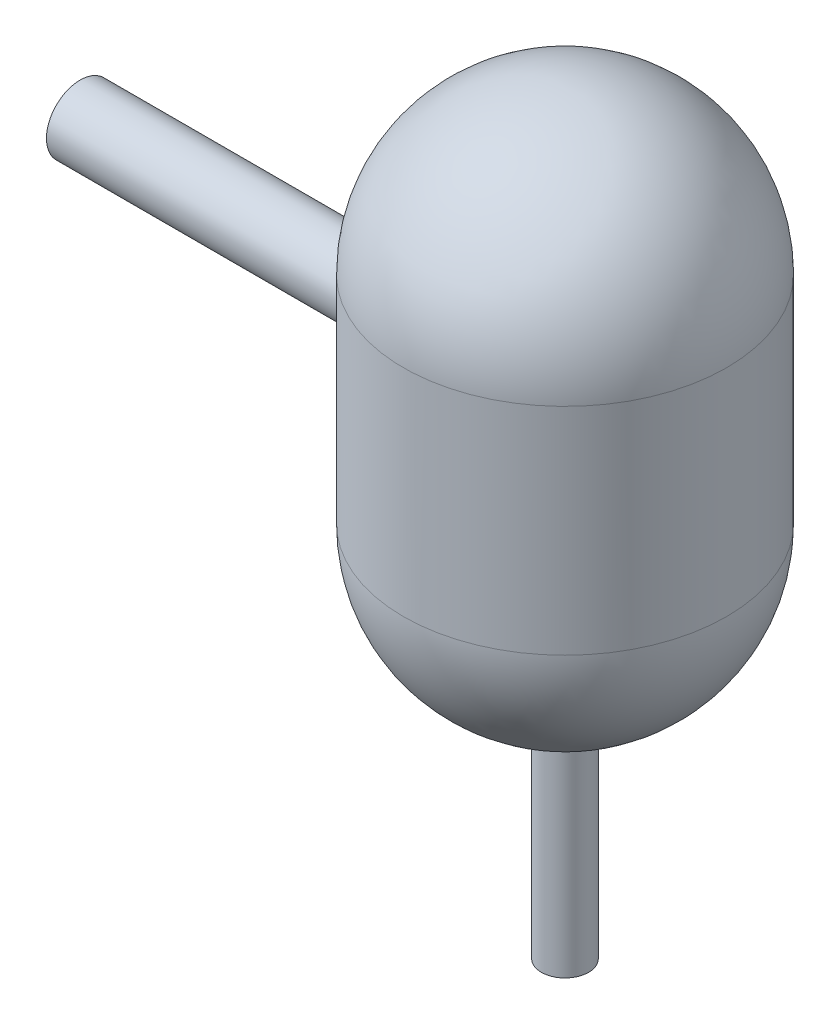
ISO-10303-21;
HEADER;
FILE_DESCRIPTION(('STEP AP214'),'2;1');
FILE_NAME('part.step','',(''),(''),'','','');
FILE_SCHEMA(('AUTOMOTIVE_DESIGN { 1 0 10303 214 1 1 1 1 }'));
ENDSEC;
DATA;
#1=APPLICATION_CONTEXT('core data for automotive mechanical design processes');
#2=APPLICATION_PROTOCOL_DEFINITION('international standard','automotive_design',2000,#1);
#3=PRODUCT_CONTEXT('',#1,'mechanical');
#4=PRODUCT('Part','Part','',(#3));
#5=PRODUCT_RELATED_PRODUCT_CATEGORY('part','',(#4));
#6=PRODUCT_DEFINITION_FORMATION('','',#4);
#7=PRODUCT_DEFINITION_CONTEXT('part definition',#1,'design');
#8=PRODUCT_DEFINITION('design','',#6,#7);
#9=PRODUCT_DEFINITION_SHAPE('','',#8);
#10=(LENGTH_UNIT() NAMED_UNIT(*) SI_UNIT(.MILLI.,.METRE.));
#11=(NAMED_UNIT(*) PLANE_ANGLE_UNIT() SI_UNIT($,.RADIAN.));
#12=(NAMED_UNIT(*) SI_UNIT($,.STERADIAN.) SOLID_ANGLE_UNIT());
#13=UNCERTAINTY_MEASURE_WITH_UNIT(LENGTH_MEASURE(1.E-05),#10,'distance_accuracy_value','');
#14=(GEOMETRIC_REPRESENTATION_CONTEXT(3) GLOBAL_UNCERTAINTY_ASSIGNED_CONTEXT((#13)) GLOBAL_UNIT_ASSIGNED_CONTEXT((#10,
#11,#12)) REPRESENTATION_CONTEXT('',''));
#15=CARTESIAN_POINT('',(0.,0.,0.));
#16=DIRECTION('',(0.,0.,1.));
#17=DIRECTION('',(1.,0.,0.));
#18=AXIS2_PLACEMENT_3D('',#15,#16,#17);
#19=CARTESIAN_POINT('',(0.,-101.6,0.));
#20=DIRECTION('',(0.,-1.,0.));
#21=DIRECTION('',(-1.,0.,0.));
#22=AXIS2_PLACEMENT_3D('',#19,#20,#21);
#23=SPHERICAL_SURFACE('',#22,152.4);
#24=CARTESIAN_POINT('',(-1.03462777964164E-12,-101.599999999999,0.));
#25=DIRECTION('',(0.,-1.,0.));
#26=DIRECTION('',(1.,0.,0.));
#27=AXIS2_PLACEMENT_3D('',#24,#25,#26);
#28=CIRCLE('',#27,152.399999999999);
#29=CARTESIAN_POINT('',(152.399999999998,-101.599999999998,0.));
#30=VERTEX_POINT('',#29);
#31=EDGE_CURVE('E58',#30,#30,#28,.T.);
#32=ORIENTED_EDGE('',*,*,#31,.T.);
#33=EDGE_LOOP('',(#32));
#34=FACE_BOUND('',#33,.T.);
#35=CARTESIAN_POINT('',(-2.4741099078387E-12,-252.370717896414,0.));
#36=DIRECTION('',(0.,1.,0.));
#37=DIRECTION('',(0.,0.,1.));
#38=AXIS2_PLACEMENT_3D('',#35,#36,#37);
#39=CIRCLE('',#38,22.225);
#40=CARTESIAN_POINT('',(-2.4741099078387E-12,-252.370717896414,22.225));
#41=VERTEX_POINT('',#40);
#42=EDGE_CURVE('E10',#41,#41,#39,.F.);
#43=ORIENTED_EDGE('',*,*,#42,.F.);
#44=EDGE_LOOP('',(#43));
#45=FACE_BOUND('',#44,.T.);
#46=ADVANCED_FACE('F43',(#34,#45),#23,.T.);
#47=CARTESIAN_POINT('',(0.,-101.6,0.));
#48=DIRECTION('',(0.,-1.,0.));
#49=DIRECTION('',(-1.,0.,0.));
#50=AXIS2_PLACEMENT_3D('',#47,#48,#49);
#51=SPHERICAL_SURFACE('',#50,146.05);
#52=CARTESIAN_POINT('',(-2.4741099078387E-12,-246.784664737706,0.));
#53=DIRECTION('',(0.,1.,0.));
#54=DIRECTION('',(0.,0.,1.));
#55=AXIS2_PLACEMENT_3D('',#52,#53,#54);
#56=CIRCLE('',#55,15.875);
#57=CARTESIAN_POINT('',(-2.4741099078387E-12,-246.784664737706,15.875));
#58=VERTEX_POINT('',#57);
#59=EDGE_CURVE('E142',#58,#58,#56,.F.);
#60=ORIENTED_EDGE('',*,*,#59,.T.);
#61=EDGE_LOOP('',(#60));
#62=FACE_BOUND('',#61,.T.);
#63=CARTESIAN_POINT('',(-1.03462777964164E-12,-101.599999999999,0.));
#64=DIRECTION('',(0.,-1.,0.));
#65=DIRECTION('',(1.,0.,0.));
#66=AXIS2_PLACEMENT_3D('',#63,#64,#65);
#67=CIRCLE('',#66,146.049999999999);
#68=CARTESIAN_POINT('',(146.049999999998,-101.599999999998,0.));
#69=VERTEX_POINT('',#68);
#70=EDGE_CURVE('E92',#69,#69,#67,.T.);
#71=ORIENTED_EDGE('',*,*,#70,.F.);
#72=EDGE_LOOP('',(#71));
#73=FACE_BOUND('',#72,.T.);
#74=ADVANCED_FACE('F111',(#62,#73),#51,.F.);
#75=CARTESIAN_POINT('',(0.,-254.,0.));
#76=DIRECTION('',(0.,-1.,0.));
#77=DIRECTION('',(1.,0.,0.));
#78=AXIS2_PLACEMENT_3D('',#75,#76,#77);
#79=CYLINDRICAL_SURFACE('',#78,146.049999999998);
#80=CARTESIAN_POINT('',(-143.824345991908,0.,-25.4));
#81=CARTESIAN_POINT('',(-143.824347807057,0.707648257176729,-25.399995821681));
#82=CARTESIAN_POINT('',(-143.829582867261,1.41539647863002,-25.3704018282657));
#83=CARTESIAN_POINT('',(-143.850375477723,2.82588085579064,-25.252237046442));
#84=CARTESIAN_POINT('',(-143.865935012859,3.52861602147658,-25.1636549175652));
#85=CARTESIAN_POINT('',(-143.906937009391,4.92454150658197,-24.9281021694573));
#86=CARTESIAN_POINT('',(-143.932387545546,5.61772354708535,-24.7810838421865));
#87=CARTESIAN_POINT('',(-143.992427172831,6.98897826584363,-24.429799805628));
#88=CARTESIAN_POINT('',(-144.027015837571,7.66705164747717,-24.2255367673854));
#89=CARTESIAN_POINT('',(-144.104297482863,9.00279286287746,-23.7615061126563));
#90=CARTESIAN_POINT('',(-144.146983442195,9.66047780500446,-23.5017865585664));
#91=CARTESIAN_POINT('',(-144.23925822079,10.9515182286093,-22.9286519436764));
#92=CARTESIAN_POINT('',(-144.28884711413,11.584873448904,-22.6152363066381));
#93=CARTESIAN_POINT('',(-144.393517065279,12.8228586851106,-21.9370095635899));
#94=CARTESIAN_POINT('',(-144.448597458254,13.4274921651948,-21.5722046768689));
#95=CARTESIAN_POINT('',(-144.562712139294,14.6040449900417,-20.7937359442799));
#96=CARTESIAN_POINT('',(-144.621746448451,15.1759641602588,-20.3800718377619));
#97=CARTESIAN_POINT('',(-144.742708320547,16.2885827603647,-19.5025350584804));
#98=CARTESIAN_POINT('',(-144.80465822912,16.8289295088241,-19.0382182425419));
#99=CARTESIAN_POINT('',(-144.929176530965,17.8686929569893,-18.065891977486));
#100=CARTESIAN_POINT('',(-144.991744928355,18.3681093840228,-17.5578822373385));
#101=CARTESIAN_POINT('',(-145.115753711906,19.3226158170212,-16.5016132642202));
#102=CARTESIAN_POINT('',(-145.177194030093,19.7777031589424,-15.9533516156998));
#103=CARTESIAN_POINT('',(-145.297227821752,20.6403590182705,-14.8203425050741));
#104=CARTESIAN_POINT('',(-145.355821290217,21.0479274521135,-14.2355949788097));
#105=CARTESIAN_POINT('',(-145.468893963858,21.8151686746619,-13.0296761908167));
#106=CARTESIAN_POINT('',(-145.523343769653,22.1745109465809,-12.4082918112134));
#107=CARTESIAN_POINT('',(-145.626157491419,22.8395100309856,-11.1369394560982));
#108=CARTESIAN_POINT('',(-145.674521372543,23.1451665360746,-10.4869713169468));
#109=CARTESIAN_POINT('',(-145.763783293351,23.700488823567,-9.16308145477337));
#110=CARTESIAN_POINT('',(-145.804681741947,23.9501576728057,-8.48916104612861));
#111=CARTESIAN_POINT('',(-145.877845187748,24.3916101485101,-7.1221644552611));
#112=CARTESIAN_POINT('',(-145.9101102796,24.5833944095597,-6.42908848313016));
#113=CARTESIAN_POINT('',(-145.964803819999,24.9059527554945,-5.03583929871039));
#114=CARTESIAN_POINT('',(-145.987327703986,25.037319601974,-4.33580704107009));
#115=CARTESIAN_POINT('',(-146.022368263055,25.240832101951,-2.92693770435822));
#116=CARTESIAN_POINT('',(-146.034884998333,25.3129781116721,-2.2181006782749));
#117=CARTESIAN_POINT('',(-146.049555377186,25.3974775110331,-0.796810686860324));
#118=CARTESIAN_POINT('',(-146.051709692722,25.4098347777211,-0.084357958991349));
#119=CARTESIAN_POINT('',(-146.045595705925,25.3746689724365,1.33902080227587));
#120=CARTESIAN_POINT('',(-146.037327464503,25.3271462504128,2.04994684457201));
#121=CARTESIAN_POINT('',(-146.010748312432,25.1734336112786,3.45745657206592));
#122=CARTESIAN_POINT('',(-145.99254681565,25.0678827765428,4.15411223343312));
#123=CARTESIAN_POINT('',(-145.946681091934,24.7993689150846,5.53594497609554));
#124=CARTESIAN_POINT('',(-145.919016944358,24.636406369852,6.22112215360589));
#125=CARTESIAN_POINT('',(-145.854989648688,24.2542974819815,7.57522072684865));
#126=CARTESIAN_POINT('',(-145.818626311805,24.0351499200238,8.24414176944765));
#127=CARTESIAN_POINT('',(-145.738200993434,23.5422979759573,9.56109486771525));
#128=CARTESIAN_POINT('',(-145.694138953938,23.268593182781,10.2091267659496));
#129=CARTESIAN_POINT('',(-145.599288591401,22.6671329220875,11.4830164947222));
#130=CARTESIAN_POINT('',(-145.548468168358,22.3391175526676,12.1087492097825));
#131=CARTESIAN_POINT('',(-145.441668404424,21.6323457234573,13.3304020605812));
#132=CARTESIAN_POINT('',(-145.385689053291,21.2535891629447,13.9263221371377));
#133=CARTESIAN_POINT('',(-145.270102032402,20.4479562649196,15.0843846610752));
#134=CARTESIAN_POINT('',(-145.210494094353,20.021076367245,15.6465246046812));
#135=CARTESIAN_POINT('',(-145.089285570395,19.1221487604475,16.7332210182079));
#136=CARTESIAN_POINT('',(-145.027684966066,18.6501006337089,17.2577771405583));
#137=CARTESIAN_POINT('',(-144.903362559402,17.657506820852,18.2724596649401));
#138=CARTESIAN_POINT('',(-144.840636699526,17.1364025771226,18.7620393388891));
#139=CARTESIAN_POINT('',(-144.716643037094,16.0546843057178,19.6956224664764));
#140=CARTESIAN_POINT('',(-144.655375248071,15.4940699115282,20.139625497231));
#141=CARTESIAN_POINT('',(-144.536037087598,14.3371715761573,20.9789473294528));
#142=CARTESIAN_POINT('',(-144.477966766337,13.740887075379,21.374265366846));
#143=CARTESIAN_POINT('',(-144.366687648799,12.5167667457953,22.1133836361457));
#144=CARTESIAN_POINT('',(-144.313478836638,11.8889310200937,22.457184036388));
#145=CARTESIAN_POINT('',(-144.213395229281,10.6052250824016,23.0911742446873));
#146=CARTESIAN_POINT('',(-144.166528863319,9.94931905816197,23.3812928930091));
#147=CARTESIAN_POINT('',(-144.0805860946,8.61487447540916,23.9051821125154));
#148=CARTESIAN_POINT('',(-144.041509710355,7.93633586311658,24.1389525497949));
#149=CARTESIAN_POINT('',(-143.972306734024,6.56154201150715,24.5483305653718));
#150=CARTESIAN_POINT('',(-143.942179435464,5.86528817540746,24.723942735018));
#151=CARTESIAN_POINT('',(-143.891771094237,4.46007271501071,25.0156483618437));
#152=CARTESIAN_POINT('',(-143.871489934197,3.75111124229909,25.1317425285066));
#153=CARTESIAN_POINT('',(-143.841579168945,2.33495631498476,25.3023716054257));
#154=CARTESIAN_POINT('',(-143.831814528806,1.62785967784538,25.3576871211702));
#155=CARTESIAN_POINT('',(-143.822757955174,0.211452945372394,25.4090040165655));
#156=CARTESIAN_POINT('',(-143.823465931455,-0.49785713083916,25.4050059072202));
#157=CARTESIAN_POINT('',(-143.835333421474,-1.91354187559937,25.3377290883641));
#158=CARTESIAN_POINT('',(-143.846492518307,-2.61991666011012,25.2744527435084));
#159=CARTESIAN_POINT('',(-143.878933177989,-4.024674530993,25.0891194878487));
#160=CARTESIAN_POINT('',(-143.900214726671,-4.72305762854722,24.9670626593018));
#161=CARTESIAN_POINT('',(-143.952094668874,-6.10200804397299,24.6661719465222));
#162=CARTESIAN_POINT('',(-143.982626996842,-6.78266568807636,24.4877402953492));
#163=CARTESIAN_POINT('',(-144.052182269333,-8.12643720208554,24.0751946551926));
#164=CARTESIAN_POINT('',(-144.09120516187,-8.78955117938319,23.8410810071485));
#165=CARTESIAN_POINT('',(-144.176635194887,-10.0937161214814,23.3188831154622));
#166=CARTESIAN_POINT('',(-144.223042701,-10.7347659919193,23.0307961993407));
#167=CARTESIAN_POINT('',(-144.3219357512,-11.9904312563902,22.4027311788599));
#168=CARTESIAN_POINT('',(-144.37442135786,-12.6050463781989,22.0627525402849));
#169=CARTESIAN_POINT('',(-144.484558392452,-13.8097263668991,21.3296411481074));
#170=CARTESIAN_POINT('',(-144.542256248718,-14.3994841024864,20.93601064082));
#171=CARTESIAN_POINT('',(-144.660739770068,-15.5438441399908,20.10101037391));
#172=CARTESIAN_POINT('',(-144.721525452843,-16.0984462404461,19.659640340752));
#173=CARTESIAN_POINT('',(-144.8444930869,-17.1687912766033,18.7321674831355));
#174=CARTESIAN_POINT('',(-144.90667513223,-17.6845315846245,18.2460616387462));
#175=CARTESIAN_POINT('',(-145.030707059412,-18.6736255763226,17.2324446412533));
#176=CARTESIAN_POINT('',(-145.092556939202,-19.1469789971406,16.7049332314145));
#177=CARTESIAN_POINT('',(-145.214908682454,-20.0532075212375,15.6058303279756));
#178=CARTESIAN_POINT('',(-145.275387141594,-20.485559674667,15.0338048892952));
#179=CARTESIAN_POINT('',(-145.392546661306,-21.3005353958863,13.8549863411238));
#180=CARTESIAN_POINT('',(-145.449227688984,-21.6831585329414,13.2481929305508));
#181=CARTESIAN_POINT('',(-145.557186768036,-22.395898336675,12.0040692550062));
#182=CARTESIAN_POINT('',(-145.608464944709,-22.7260162210963,11.3667396986988));
#183=CARTESIAN_POINT('',(-145.704163274329,-23.3313106648686,10.0660072115682));
#184=CARTESIAN_POINT('',(-145.74858348121,-23.6064876562936,9.40260448584233));
#185=CARTESIAN_POINT('',(-145.829109570533,-24.0986597209623,8.05760528022181));
#186=CARTESIAN_POINT('',(-145.865253485425,-24.3159217225833,7.37610876873769));
#187=CARTESIAN_POINT('',(-145.928465866419,-24.6922883363599,5.9968245975265));
#188=CARTESIAN_POINT('',(-145.955534349215,-24.8513930555009,5.29903696777092));
#189=CARTESIAN_POINT('',(-145.999821514453,-25.1101903594269,3.89227320422706));
#190=CARTESIAN_POINT('',(-146.017040939194,-25.2098874216497,3.18329791776563));
#191=CARTESIAN_POINT('',(-146.041139598766,-25.3490961435204,1.75929055965304));
#192=CARTESIAN_POINT('',(-146.048018935651,-25.388608397182,1.04425854785076));
#193=CARTESIAN_POINT('',(-146.051219467772,-25.4070122442899,-0.377166103816299));
#194=CARTESIAN_POINT('',(-146.047678730381,-25.386696563413,-1.08354829622425));
#195=CARTESIAN_POINT('',(-146.030436147858,-25.2873124631685,-2.49203685505949));
#196=CARTESIAN_POINT('',(-146.016734398309,-25.2082445964772,-3.19414326164609));
#197=CARTESIAN_POINT('',(-145.979552574292,-24.9919705993141,-4.5890690762766));
#198=CARTESIAN_POINT('',(-145.956072609162,-24.8547651189337,-5.28188858807667));
#199=CARTESIAN_POINT('',(-145.899987807061,-24.5232664505549,-6.65335327468512));
#200=CARTESIAN_POINT('',(-145.867382940593,-24.3289730780208,-7.33199840366743));
#201=CARTESIAN_POINT('',(-145.794000754214,-23.8850574418073,-8.66947846228425));
#202=CARTESIAN_POINT('',(-145.753234359828,-23.6355090990113,-9.32833853573117));
#203=CARTESIAN_POINT('',(-145.66462323225,-23.082771301227,-10.6226583427382));
#204=CARTESIAN_POINT('',(-145.616778515182,-22.7795819684367,-11.2581181296019));
#205=CARTESIAN_POINT('',(-145.515317844999,-22.1217268142548,-12.5013530262214));
#206=CARTESIAN_POINT('',(-145.461701669137,-21.7670590058859,-13.1091270661666));
#207=CARTESIAN_POINT('',(-145.350160709963,-21.0087437381572,-14.292892925122));
#208=CARTESIAN_POINT('',(-145.292235884311,-20.6050957974516,-14.8688844317126));
#209=CARTESIAN_POINT('',(-145.172915197401,-19.7462860744045,-15.9921923007209));
#210=CARTESIAN_POINT('',(-145.111485143607,-19.2905463971028,-16.5390632961552));
#211=CARTESIAN_POINT('',(-144.987534233838,-18.3348578366097,-17.5925782736547));
#212=CARTESIAN_POINT('',(-144.925013365922,-17.834908469242,-18.0992218150409));
#213=CARTESIAN_POINT('',(-144.800612455973,-16.7941004367084,-19.0689331326828));
#214=CARTESIAN_POINT('',(-144.738732568488,-16.2532321550324,-19.5319906078697));
#215=CARTESIAN_POINT('',(-144.617366556769,-15.1343784736904,-20.4111927782819));
#216=CARTESIAN_POINT('',(-144.557880409543,-14.5563934306569,-20.8273379241535));
#217=CARTESIAN_POINT('',(-144.442535694809,-13.3626059875842,-21.6128494231936));
#218=CARTESIAN_POINT('',(-144.386708968154,-12.746544241106,-21.9818264419696));
#219=CARTESIAN_POINT('',(-144.280809536048,-11.484969111572,-22.6665079126069));
#220=CARTESIAN_POINT('',(-144.230737156037,-10.8394540656599,-22.9822093519286));
#221=CARTESIAN_POINT('',(-144.137858245167,-9.52416088850097,-23.5577002561487));
#222=CARTESIAN_POINT('',(-144.095045254956,-8.85440497748424,-23.817539482586));
#223=CARTESIAN_POINT('',(-144.017902872834,-7.49493381581031,-24.2796446460518));
#224=CARTESIAN_POINT('',(-143.983571693804,-6.80522280396581,-24.4819227125887));
#225=CARTESIAN_POINT('',(-143.932829627879,-5.60941335844449,-24.7781877367034));
#226=CARTESIAN_POINT('',(-143.914099454482,-5.10693637753417,-24.8866099697526));
#227=CARTESIAN_POINT('',(-143.881774919678,-4.09606893361758,-25.0728205036862));
#228=CARTESIAN_POINT('',(-143.8681813152,-3.58767761043929,-25.1506042897416));
#229=CARTESIAN_POINT('',(-143.846347560508,-2.56700566094737,-25.2751815130496));
#230=CARTESIAN_POINT('',(-143.838107324688,-2.05472509695995,-25.3219754458678));
#231=CARTESIAN_POINT('',(-143.827106297981,-1.02831375197169,-25.3843838342496));
#232=CARTESIAN_POINT('',(-143.824344673005,-0.514183264553841,-25.4000030360023));
#233=CARTESIAN_POINT('',(-143.824345991908,0.,-25.4));
#234=B_SPLINE_CURVE_WITH_KNOTS('',3,(#80,#81,#82,#83,#84,#85,#86,#87,#88,#89,#90,#91,#92,#93,
#94,#95,#96,#97,#98,#99,#100,#101,#102,#103,#104,#105,#106,#107,#108,#109,#110,#111,#112,#113,
#114,#115,#116,#117,#118,#119,#120,#121,#122,#123,#124,#125,#126,#127,#128,#129,#130,#131,#132,
#133,#134,#135,#136,#137,#138,#139,#140,#141,#142,#143,#144,#145,#146,#147,#148,#149,#150,#151,
#152,#153,#154,#155,#156,#157,#158,#159,#160,#161,#162,#163,#164,#165,#166,#167,#168,#169,#170,
#171,#172,#173,#174,#175,#176,#177,#178,#179,#180,#181,#182,#183,#184,#185,#186,#187,#188,#189,
#190,#191,#192,#193,#194,#195,#196,#197,#198,#199,#200,#201,#202,#203,#204,#205,#206,#207,#208,
#209,#210,#211,#212,#213,#214,#215,#216,#217,#218,#219,#220,#221,#222,#223,#224,#225,#226,#227,
#228,#229,#230,#231,#232,#233),.UNSPECIFIED.,.T.,.F.,(4,2,2,2,2,2,2,2,2,2,2,2,2,2,2,2,2,2,2,2,2,
2,2,2,2,2,2,2,2,2,2,2,2,2,2,2,2,2,2,2,2,2,2,2,2,2,2,2,2,2,2,2,2,2,2,2,2,2,2,2,2,2,2,2,2,2,2,2,2,
2,2,2,2,2,2,2,4),(0.,2.12248165687478,4.24537147867325,6.36999802580033,8.49452545410012,
10.6172190418535,12.7399354106748,14.8623951020312,16.9848661166136,19.1277261221698,
21.2706004020114,23.4136033827572,25.5566101320027,27.7136259816848,29.8706541817156,
32.0275641973542,34.1844505661053,36.3196987160541,38.4549340220188,40.5900308651172,
42.7251152304029,44.8371430588732,46.9491531750037,49.0612091295763,51.1732809982649,
53.2957688544981,55.4182609239771,57.5409101184853,59.6635789404442,61.8143046689101,
63.9650503511195,66.115829783348,68.266602187672,70.4202055128107,72.5738139556907,
74.7272523397619,76.8806650532077,79.0060850541468,81.1314867439941,83.2568036535209,
85.382117588905,87.4925974670659,89.60306442314,91.7136359063315,93.8242291189286,
95.9559378437351,98.0876587833405,100.219523732377,102.351401901092,104.507582650097,
106.663782073909,108.819931482172,110.976063933077,113.122079934563,115.268091988239,
117.413942280757,119.559771393968,121.677296540117,123.794801767152,125.91228331699,
128.02977171163,130.14444423449,132.259111940031,134.373861289686,136.488631423449,
138.629685269085,140.770762566046,142.912344618254,145.053906096372,147.212137238231,
149.370490379319,151.526912839205,153.682880552418,155.22512617946,156.767598984231,
158.310047122382,159.852260412982),.UNSPECIFIED.);
#235=CARTESIAN_POINT('',(-143.824345991908,0.,-25.4));
#236=VERTEX_POINT('',#235);
#237=EDGE_CURVE('E81',#236,#236,#234,.T.);
#238=ORIENTED_EDGE('',*,*,#237,.F.);
#239=EDGE_LOOP('',(#238));
#240=FACE_BOUND('',#239,.T.);
#241=CARTESIAN_POINT('',(-2.4741099078387E-12,101.600000000001,0.));
#242=DIRECTION('',(0.,-1.,0.));
#243=DIRECTION('',(1.,0.,0.));
#244=AXIS2_PLACEMENT_3D('',#241,#242,#243);
#245=CIRCLE('',#244,146.049999999998);
#246=CARTESIAN_POINT('',(146.049999999995,101.600000000002,0.));
#247=VERTEX_POINT('',#246);
#248=EDGE_CURVE('E87',#247,#247,#245,.T.);
#249=ORIENTED_EDGE('',*,*,#248,.F.);
#250=EDGE_LOOP('',(#249));
#251=FACE_BOUND('',#250,.T.);
#252=ORIENTED_EDGE('',*,*,#70,.T.);
#253=EDGE_LOOP('',(#252));
#254=FACE_BOUND('',#253,.T.);
#255=ADVANCED_FACE('F115',(#240,#251,#254),#79,.F.);
#256=CARTESIAN_POINT('',(0.,101.6,0.));
#257=DIRECTION('',(0.,-1.,0.));
#258=DIRECTION('',(-1.,0.,0.));
#259=AXIS2_PLACEMENT_3D('',#256,#257,#258);
#260=SPHERICAL_SURFACE('',#259,146.05);
#261=ORIENTED_EDGE('',*,*,#248,.T.);
#262=EDGE_LOOP('',(#261));
#263=FACE_BOUND('',#262,.T.);
#264=ADVANCED_FACE('F120',(#263),#260,.F.);
#265=CARTESIAN_POINT('',(-152.401,0.,0.));
#266=DIRECTION('',(1.,0.,0.));
#267=DIRECTION('',(0.,0.,-1.));
#268=AXIS2_PLACEMENT_3D('',#265,#266,#267);
#269=CYLINDRICAL_SURFACE('',#268,25.4);
#270=ORIENTED_EDGE('',*,*,#237,.T.);
#271=EDGE_LOOP('',(#270));
#272=FACE_BOUND('',#271,.T.);
#273=CARTESIAN_POINT('',(-457.2,0.,0.));
#274=DIRECTION('',(1.,0.,0.));
#275=DIRECTION('',(0.,0.,-1.));
#276=AXIS2_PLACEMENT_3D('',#273,#274,#275);
#277=CIRCLE('',#276,25.4);
#278=CARTESIAN_POINT('',(-457.2,0.,-25.4));
#279=VERTEX_POINT('',#278);
#280=EDGE_CURVE('E88',#279,#279,#277,.T.);
#281=ORIENTED_EDGE('',*,*,#280,.F.);
#282=EDGE_LOOP('',(#281));
#283=FACE_BOUND('',#282,.T.);
#284=ADVANCED_FACE('F73',(#272,#283),#269,.F.);
#285=CARTESIAN_POINT('',(152.400999999998,0.,0.));
#286=DIRECTION('',(-1.,0.,0.));
#287=DIRECTION('',(0.,0.,1.));
#288=AXIS2_PLACEMENT_3D('',#285,#286,#287);
#289=CYLINDRICAL_SURFACE('',#288,31.75);
#290=CARTESIAN_POINT('',(-457.2,0.,0.));
#291=DIRECTION('',(1.,0.,0.));
#292=DIRECTION('',(0.,0.,-1.));
#293=AXIS2_PLACEMENT_3D('',#290,#291,#292);
#294=CIRCLE('',#293,31.75);
#295=CARTESIAN_POINT('',(-457.2,0.,-31.75));
#296=VERTEX_POINT('',#295);
#297=EDGE_CURVE('E140',#296,#296,#294,.T.);
#298=ORIENTED_EDGE('',*,*,#297,.T.);
#299=EDGE_LOOP('',(#298));
#300=FACE_BOUND('',#299,.T.);
#301=CARTESIAN_POINT('',(-149.05602134768,0.,31.75));
#302=CARTESIAN_POINT('',(-149.056023793011,0.881361721170962,31.7499952828106));
#303=CARTESIAN_POINT('',(-149.063859807178,1.76282805008693,31.713269405636));
#304=CARTESIAN_POINT('',(-149.094978038728,3.51946176256128,31.5666437928695));
#305=CARTESIAN_POINT('',(-149.118262741641,4.39462810961189,31.4567322824722));
#306=CARTESIAN_POINT('',(-149.179606564309,6.13289927227794,31.1645194418269));
#307=CARTESIAN_POINT('',(-149.217675932306,6.99599529026554,30.9821678965273));
#308=CARTESIAN_POINT('',(-149.307463028166,8.70332289076777,30.5465360443894));
#309=CARTESIAN_POINT('',(-149.359180238586,9.54755518716528,30.2932584266189));
#310=CARTESIAN_POINT('',(-149.474693960176,11.2104401207116,29.7180374402765));
#311=CARTESIAN_POINT('',(-149.538477812951,12.0291185257382,29.3961659850469));
#312=CARTESIAN_POINT('',(-149.676329226527,13.6362424040242,28.6860106989017));
#313=CARTESIAN_POINT('',(-149.750396874912,14.4246876197241,28.2977263023616));
#314=CARTESIAN_POINT('',(-149.906715653356,15.9660196496083,27.4575865536702));
#315=CARTESIAN_POINT('',(-149.988966241035,16.7189088156512,27.0057354140362));
#316=CARTESIAN_POINT('',(-150.159363235695,18.1842384302228,26.0416048805845));
#317=CARTESIAN_POINT('',(-150.247509696821,18.8966785071906,25.5293249318072));
#318=CARTESIAN_POINT('',(-150.42851221403,20.2859738197001,24.4403649007374));
#319=CARTESIAN_POINT('',(-150.521416408337,20.9622039446122,23.8628951456976));
#320=CARTESIAN_POINT('',(-150.708192854998,22.2638009244068,22.6533654850093));
#321=CARTESIAN_POINT('',(-150.802065116117,22.8891673183038,22.0213050847046));
#322=CARTESIAN_POINT('',(-150.988175506019,24.0848609822646,20.7067965021893));
#323=CARTESIAN_POINT('',(-151.080413517565,24.6551843166605,20.0243447230623));
#324=CARTESIAN_POINT('',(-151.260693274568,25.7368275134811,18.6136565672592));
#325=CARTESIAN_POINT('',(-151.3487350084,26.2481472124502,17.885420063756));
#326=CARTESIAN_POINT('',(-151.518989288063,27.2127585283132,16.3809136844706));
#327=CARTESIAN_POINT('',(-151.601138365452,27.6654514190504,15.6042525526756));
#328=CARTESIAN_POINT('',(-151.756344803468,28.5036913070007,14.0146165246614));
#329=CARTESIAN_POINT('',(-151.829402088581,28.8892377465196,13.2016413269013));
#330=CARTESIAN_POINT('',(-151.964336046109,29.5902058990911,11.5451700013931));
#331=CARTESIAN_POINT('',(-152.026213596907,29.9056331218008,10.7016762777157));
#332=CARTESIAN_POINT('',(-152.137017324175,30.4639042654189,8.99017370277654));
#333=CARTESIAN_POINT('',(-152.185943706476,30.7067493398678,8.12216524136494));
#334=CARTESIAN_POINT('',(-152.268835808032,31.1149521640189,6.38050305935047));
#335=CARTESIAN_POINT('',(-152.30300492904,31.2813655621775,5.50710637393582));
#336=CARTESIAN_POINT('',(-152.356419295733,31.5404043028025,3.74898518956694));
#337=CARTESIAN_POINT('',(-152.37566466933,31.6330302777071,2.86426078776956));
#338=CARTESIAN_POINT('',(-152.398683832391,31.7437281169389,1.09004008506075));
#339=CARTESIAN_POINT('',(-152.402459033338,31.7618067828883,0.200544226907542));
#340=CARTESIAN_POINT('',(-152.394434073458,31.72327845416,-1.57675367499099));
#341=CARTESIAN_POINT('',(-152.382634044699,31.6666720927621,-2.46455573303469));
#342=CARTESIAN_POINT('',(-152.344096160726,31.4806960669351,-4.2182642160708));
#343=CARTESIAN_POINT('',(-152.317592228358,31.3524656498803,-5.08429689303012));
#344=CARTESIAN_POINT('',(-152.250543254694,31.0250876174821,-6.80228581090756));
#345=CARTESIAN_POINT('',(-152.209998382413,30.8259408557812,-7.65424222113703));
#346=CARTESIAN_POINT('',(-152.115974232606,30.3582695887926,-9.33817939210086));
#347=CARTESIAN_POINT('',(-152.062494600092,30.0897431794079,-10.1701596039114));
#348=CARTESIAN_POINT('',(-151.944053174094,29.4853446474254,-11.808441589649));
#349=CARTESIAN_POINT('',(-151.879091261049,29.149471823561,-12.6147430960868));
#350=CARTESIAN_POINT('',(-151.73896542674,28.4103609760771,-14.2015892908402));
#351=CARTESIAN_POINT('',(-151.663735707029,28.0066842499214,-14.9819237970777));
#352=CARTESIAN_POINT('',(-151.505455112317,27.1364772667449,-16.5058792057833));
#353=CARTESIAN_POINT('',(-151.422404217005,26.6699468465,-17.2495000129033));
#354=CARTESIAN_POINT('',(-151.250714935924,25.6772312729437,-18.6952206417908));
#355=CARTESIAN_POINT('',(-151.16207596788,25.1510398984229,-19.3973161218239));
#356=CARTESIAN_POINT('',(-150.981606094898,24.0426041061395,-20.7553349681485));
#357=CARTESIAN_POINT('',(-150.88977514794,23.4603589503142,-21.4112577262848));
#358=CARTESIAN_POINT('',(-150.703652899894,22.232156485601,-22.684595898891));
#359=CARTESIAN_POINT('',(-150.609347917014,21.5852023431495,-23.3010482237509));
#360=CARTESIAN_POINT('',(-150.422647062936,20.2414877195149,-24.4773778533212));
#361=CARTESIAN_POINT('',(-150.330251216931,19.5447265816488,-25.0372544118705));
#362=CARTESIAN_POINT('',(-150.149986868233,18.1060832331567,-26.0965555409302));
#363=CARTESIAN_POINT('',(-150.062118494389,17.3641997396869,-26.5959783915133));
#364=CARTESIAN_POINT('',(-149.893433245691,15.8403634962124,-27.5307892961407));
#365=CARTESIAN_POINT('',(-149.812616341892,15.0584109107025,-27.9661776130364));
#366=CARTESIAN_POINT('',(-149.660193866448,13.4577960147782,-28.7707234964289));
#367=CARTESIAN_POINT('',(-149.588611873144,12.6390466640987,-29.1397124454041));
#368=CARTESIAN_POINT('',(-149.457022121294,10.9724168889283,-29.807287383968));
#369=CARTESIAN_POINT('',(-149.397014406869,10.1245363534011,-30.1058731051739));
#370=CARTESIAN_POINT('',(-149.290388284776,8.40583133622129,-30.6302403142809));
#371=CARTESIAN_POINT('',(-149.243768314355,7.53500954546865,-30.8560303000088));
#372=CARTESIAN_POINT('',(-149.165333277635,5.77671133906899,-31.2330032493508));
#373=CARTESIAN_POINT('',(-149.133517950778,4.88923521681956,-31.3841875260072));
#374=CARTESIAN_POINT('',(-149.08611646575,3.12079750355149,-31.6085870856365));
#375=CARTESIAN_POINT('',(-149.070240255903,2.2400203600631,-31.6831964221137));
#376=CARTESIAN_POINT('',(-149.05416712867,0.47517362492991,-31.7587275842125));
#377=CARTESIAN_POINT('',(-149.053970018497,-0.408895926098297,-31.7596503158728));
#378=CARTESIAN_POINT('',(-149.06926045314,-2.17384425519209,-31.6878039526567));
#379=CARTESIAN_POINT('',(-149.084747090119,-3.05472321497959,-31.6150391231004));
#380=CARTESIAN_POINT('',(-149.130939947624,-4.80695569981857,-31.3964201890013));
#381=CARTESIAN_POINT('',(-149.161646131204,-5.67830924798813,-31.2505662618851));
#382=CARTESIAN_POINT('',(-149.236963136472,-7.39609681065613,-30.8888736509908));
#383=CARTESIAN_POINT('',(-149.281423456751,-8.24269691678902,-30.6737914973254));
#384=CARTESIAN_POINT('',(-149.383066107913,-9.91459712449868,-30.1748952025384));
#385=CARTESIAN_POINT('',(-149.440248322397,-10.7398974208798,-29.8910816902685));
#386=CARTESIAN_POINT('',(-149.56571265622,-12.3636672556485,-29.2568286637143));
#387=CARTESIAN_POINT('',(-149.633995521078,-13.1621349876128,-28.9063846742612));
#388=CARTESIAN_POINT('',(-149.779744490879,-14.7268898777349,-28.1414224006901));
#389=CARTESIAN_POINT('',(-149.857210728587,-15.4931765704309,-27.7269031902032));
#390=CARTESIAN_POINT('',(-150.02032636375,-16.9990896499508,-26.8304316548779));
#391=CARTESIAN_POINT('',(-150.106075527279,-17.7381895126123,-26.3476129350963));
#392=CARTESIAN_POINT('',(-150.282415062209,-19.1732623502505,-25.3224433971349));
#393=CARTESIAN_POINT('',(-150.373005471807,-19.8692349848599,-24.7800921092078));
#394=CARTESIAN_POINT('',(-150.556528577057,-21.2135407464031,-23.6394859375043));
#395=CARTESIAN_POINT('',(-150.649461501855,-21.8618691882804,-23.0412255690549));
#396=CARTESIAN_POINT('',(-150.835110886347,-23.1065351429248,-21.7928308156351));
#397=CARTESIAN_POINT('',(-150.927827344024,-23.7028721732589,-21.1426959494238));
#398=CARTESIAN_POINT('',(-151.112047267748,-24.849120036315,-19.7835092333741));
#399=CARTESIAN_POINT('',(-151.203504215055,-25.3980830258915,-19.0736513105691));
#400=CARTESIAN_POINT('',(-151.380999701828,-26.4342621904369,-17.6095599634666));
#401=CARTESIAN_POINT('',(-151.467038172843,-26.9214775854428,-16.8553259788103));
#402=CARTESIAN_POINT('',(-151.631264147869,-27.8306079349469,-15.3076827606786));
#403=CARTESIAN_POINT('',(-151.709451875879,-28.2525247527314,-14.5142746458844));
#404=CARTESIAN_POINT('',(-151.855759985133,-29.0279069165206,-12.8937925567606));
#405=CARTESIAN_POINT('',(-151.923880476059,-29.381373008301,-12.0667189493379));
#406=CARTESIAN_POINT('',(-152.047732901438,-30.0151903781421,-10.3898677825041));
#407=CARTESIAN_POINT('',(-152.103537425484,-30.2959718500612,-9.54025822906387));
#408=CARTESIAN_POINT('',(-152.201693951248,-30.7849895310825,-7.81964259886));
#409=CARTESIAN_POINT('',(-152.244045981876,-30.9932258960863,-6.9486365680824));
#410=CARTESIAN_POINT('',(-152.31408140025,-31.3354429024708,-5.19167009262058));
#411=CARTESIAN_POINT('',(-152.341766397639,-31.4694316922772,-4.30571129995386));
#412=CARTESIAN_POINT('',(-152.381677558314,-31.6620762603731,-2.52529913960406));
#413=CARTESIAN_POINT('',(-152.393903947224,-31.720733138164,-1.63084589609308));
#414=CARTESIAN_POINT('',(-152.402464950536,-31.7618352950035,0.142964838628272));
#415=CARTESIAN_POINT('',(-152.399095369428,-31.7456991444763,1.02228835333569));
#416=CARTESIAN_POINT('',(-152.377232753831,-31.640578426435,2.77637137134005));
#417=CARTESIAN_POINT('',(-152.358739922879,-31.5515948393388,3.6511309359015));
#418=CARTESIAN_POINT('',(-152.307144740157,-31.3014979834422,5.38981606170031));
#419=CARTESIAN_POINT('',(-152.274042679873,-31.1403861537575,6.25374183874181));
#420=CARTESIAN_POINT('',(-152.194144050562,-30.7473083494133,7.96467119092832));
#421=CARTESIAN_POINT('',(-152.147347426755,-30.5153420913211,8.81167469836625));
#422=CARTESIAN_POINT('',(-152.041488133814,-29.9830684706861,10.480611970826));
#423=CARTESIAN_POINT('',(-151.982458757311,-29.6829463926664,11.3026069761799));
#424=CARTESIAN_POINT('',(-151.85366011551,-29.0162625602483,12.918311014309));
#425=CARTESIAN_POINT('',(-151.783890891746,-28.6497010627875,13.7120201564585));
#426=CARTESIAN_POINT('',(-151.635487182949,-27.8527678246069,15.265919895232));
#427=CARTESIAN_POINT('',(-151.556852120843,-27.4223919296634,16.0261083055227));
#428=CARTESIAN_POINT('',(-151.3928260653,-26.5008638426192,17.5079413592259));
#429=CARTESIAN_POINT('',(-151.307434976388,-26.0097107915732,18.229585457697));
#430=CARTESIAN_POINT('',(-151.130650296245,-24.9609229083136,19.6418381959651));
#431=CARTESIAN_POINT('',(-151.03917814929,-24.4022805617473,20.3316889784008));
#432=CARTESIAN_POINT('',(-150.854121854503,-23.2293747440773,21.6620654718477));
#433=CARTESIAN_POINT('',(-150.760537678103,-22.6151105202887,22.3025905151572));
#434=CARTESIAN_POINT('',(-150.573824229323,-21.3349482520032,23.5301743365651));
#435=CARTESIAN_POINT('',(-150.480695069624,-20.6690380446123,24.1172204488817));
#436=CARTESIAN_POINT('',(-150.297508004706,-19.2901592022813,25.2336919579203));
#437=CARTESIAN_POINT('',(-150.207450081272,-18.5771908465068,25.7631176964174));
#438=CARTESIAN_POINT('',(-150.031898594113,-17.1002048694315,26.7666219356624));
#439=CARTESIAN_POINT('',(-149.946472028957,-16.3356810832084,27.2399675456206));
#440=CARTESIAN_POINT('',(-149.783842748697,-14.7685243670524,28.1204732339352));
#441=CARTESIAN_POINT('',(-149.706640467555,-13.9658894293733,28.5276298203561));
#442=CARTESIAN_POINT('',(-149.562807156068,-12.3288302192668,29.2723504480008));
#443=CARTESIAN_POINT('',(-149.496167742859,-11.4944318137239,29.6099697395174));
#444=CARTESIAN_POINT('',(-149.375395700917,-9.79926292059891,30.2133414749831));
#445=CARTESIAN_POINT('',(-149.321260728686,-8.93849740886697,30.4791073868024));
#446=CARTESIAN_POINT('',(-149.238695270566,-7.41089463638933,30.8804569270777));
#447=CARTESIAN_POINT('',(-149.207217189064,-6.7483595554521,31.0319824780746));
#448=CARTESIAN_POINT('',(-149.152839743152,-5.41443504685144,31.2923019337143));
#449=CARTESIAN_POINT('',(-149.129941967236,-4.74304400345453,31.4010879260543));
#450=CARTESIAN_POINT('',(-149.093143397365,-3.39443990643055,31.5753469969931));
#451=CARTESIAN_POINT('',(-149.079242319916,-2.71722703693684,31.6408214403861));
#452=CARTESIAN_POINT('',(-149.060681245535,-1.36002982973364,31.7281455420932));
#453=CARTESIAN_POINT('',(-149.056019460898,-0.680046053684953,31.7500036397156));
#454=CARTESIAN_POINT('',(-149.05602134768,0.,31.75));
#455=B_SPLINE_CURVE_WITH_KNOTS('',3,(#301,#302,#303,#304,#305,#306,#307,#308,#309,#310,#311,
#312,#313,#314,#315,#316,#317,#318,#319,#320,#321,#322,#323,#324,#325,#326,#327,#328,#329,#330,
#331,#332,#333,#334,#335,#336,#337,#338,#339,#340,#341,#342,#343,#344,#345,#346,#347,#348,#349,
#350,#351,#352,#353,#354,#355,#356,#357,#358,#359,#360,#361,#362,#363,#364,#365,#366,#367,#368,
#369,#370,#371,#372,#373,#374,#375,#376,#377,#378,#379,#380,#381,#382,#383,#384,#385,#386,#387,
#388,#389,#390,#391,#392,#393,#394,#395,#396,#397,#398,#399,#400,#401,#402,#403,#404,#405,#406,
#407,#408,#409,#410,#411,#412,#413,#414,#415,#416,#417,#418,#419,#420,#421,#422,#423,#424,#425,
#426,#427,#428,#429,#430,#431,#432,#433,#434,#435,#436,#437,#438,#439,#440,#441,#442,#443,#444,
#445,#446,#447,#448,#449,#450,#451,#452,#453,#454),.UNSPECIFIED.,.T.,.F.,(4,2,2,2,2,2,2,2,2,2,2,
2,2,2,2,2,2,2,2,2,2,2,2,2,2,2,2,2,2,2,2,2,2,2,2,2,2,2,2,2,2,2,2,2,2,2,2,2,2,2,2,2,2,2,2,2,2,2,2,
2,2,2,2,2,2,2,2,2,2,2,2,2,2,2,2,2,4),(0.,2.64346907969791,5.28736356880845,7.93309399871434,
10.5787241328414,13.2215941315877,15.8644866401988,18.5072040888641,21.1499458093207,
23.8290790183864,26.5082365061292,29.1875854162664,31.8669417487235,34.5718038811794,
37.2766884781665,39.9813604621326,42.6859894587463,45.3520481012623,48.0180838925198,
50.68387643195,53.3496463673681,55.9741749819009,58.5986720052124,61.223241064453,
63.8478374542923,66.490120240041,69.1324098876345,71.7749753166316,74.4175755451702,
77.1101626011372,79.802785164212,82.4954843152664,85.1881724129247,87.8876048054991,
90.5870474883645,93.2861749369739,95.9852548798965,98.634276156826,101.283264861805,
103.932100241865,106.580929191804,109.20174204941,111.822530929015,114.443495893481,
117.06449875415,119.722363676529,122.380249572553,125.038396481065,127.696568052134,
130.399379821369,133.102225727691,135.804994494434,138.507733812652,141.194090657543,
143.880441729337,146.566497924573,149.252514915226,151.887797982375,154.52304558313,
157.158240607295,159.793446172932,162.42157180514,165.04968727395,167.677973904397,
170.306297683865,172.980324119476,175.654386745889,178.329081051284,181.003759490874,
183.710238522633,186.416860293853,189.121323173346,191.825278788655,193.865023209248,
195.905145066572,197.945202634368,199.984865433994),.UNSPECIFIED.);
#456=CARTESIAN_POINT('',(-149.05602134768,0.,31.75));
#457=VERTEX_POINT('',#456);
#458=EDGE_CURVE('E50',#457,#457,#455,.T.);
#459=ORIENTED_EDGE('',*,*,#458,.T.);
#460=EDGE_LOOP('',(#459));
#461=FACE_BOUND('',#460,.T.);
#462=ADVANCED_FACE('F67',(#300,#461),#289,.T.);
#463=CARTESIAN_POINT('',(-457.2,0.,0.));
#464=DIRECTION('',(1.,0.,0.));
#465=DIRECTION('',(0.,0.,-1.));
#466=AXIS2_PLACEMENT_3D('',#463,#464,#465);
#467=PLANE('',#466);
#468=ORIENTED_EDGE('',*,*,#297,.F.);
#469=EDGE_LOOP('',(#468));
#470=FACE_BOUND('',#469,.T.);
#471=ORIENTED_EDGE('',*,*,#280,.T.);
#472=EDGE_LOOP('',(#471));
#473=FACE_BOUND('',#472,.T.);
#474=ADVANCED_FACE('F72',(#470,#473),#467,.F.);
#475=CARTESIAN_POINT('',(0.,101.6,0.));
#476=DIRECTION('',(0.,-1.,0.));
#477=DIRECTION('',(1.,0.,0.));
#478=AXIS2_PLACEMENT_3D('',#475,#476,#477);
#479=SPHERICAL_SURFACE('',#478,152.4);
#480=CARTESIAN_POINT('',(-2.4741099078387E-12,101.600000000001,0.));
#481=DIRECTION('',(0.,-1.,0.));
#482=DIRECTION('',(1.,0.,0.));
#483=AXIS2_PLACEMENT_3D('',#480,#481,#482);
#484=CIRCLE('',#483,152.399999999998);
#485=CARTESIAN_POINT('',(152.399999999995,101.600000000002,0.));
#486=VERTEX_POINT('',#485);
#487=EDGE_CURVE('E54',#486,#486,#484,.T.);
#488=ORIENTED_EDGE('',*,*,#487,.F.);
#489=EDGE_LOOP('',(#488));
#490=FACE_BOUND('',#489,.T.);
#491=ADVANCED_FACE('F45',(#490),#479,.T.);
#492=CARTESIAN_POINT('',(0.,-254.,0.));
#493=DIRECTION('',(0.,-1.,0.));
#494=DIRECTION('',(1.,0.,0.));
#495=AXIS2_PLACEMENT_3D('',#492,#493,#494);
#496=CYLINDRICAL_SURFACE('',#495,152.399999999998);
#497=ORIENTED_EDGE('',*,*,#487,.T.);
#498=EDGE_LOOP('',(#497));
#499=FACE_BOUND('',#498,.T.);
#500=ORIENTED_EDGE('',*,*,#31,.F.);
#501=EDGE_LOOP('',(#500));
#502=FACE_BOUND('',#501,.T.);
#503=ORIENTED_EDGE('',*,*,#458,.F.);
#504=EDGE_LOOP('',(#503));
#505=FACE_BOUND('',#504,.T.);
#506=ADVANCED_FACE('F64',(#499,#502,#505),#496,.T.);
#507=CARTESIAN_POINT('',(-2.4741099078387E-12,254.001,0.));
#508=DIRECTION('',(0.,-1.,0.));
#509=DIRECTION('',(0.,0.,-1.));
#510=AXIS2_PLACEMENT_3D('',#507,#508,#509);
#511=CYLINDRICAL_SURFACE('',#510,15.875);
#512=ORIENTED_EDGE('',*,*,#59,.F.);
#513=EDGE_LOOP('',(#512));
#514=FACE_BOUND('',#513,.T.);
#515=CARTESIAN_POINT('',(-2.4741099078387E-12,-457.2,0.));
#516=DIRECTION('',(0.,1.,0.));
#517=DIRECTION('',(0.,0.,1.));
#518=AXIS2_PLACEMENT_3D('',#515,#516,#517);
#519=CIRCLE('',#518,15.875);
#520=CARTESIAN_POINT('',(-2.4741099078387E-12,-457.2,15.875));
#521=VERTEX_POINT('',#520);
#522=EDGE_CURVE('E148',#521,#521,#519,.T.);
#523=ORIENTED_EDGE('',*,*,#522,.F.);
#524=EDGE_LOOP('',(#523));
#525=FACE_BOUND('',#524,.T.);
#526=ADVANCED_FACE('F101',(#514,#525),#511,.F.);
#527=CARTESIAN_POINT('',(-2.4741099078387E-12,254.001,0.));
#528=DIRECTION('',(0.,-1.,0.));
#529=DIRECTION('',(0.,0.,-1.));
#530=AXIS2_PLACEMENT_3D('',#527,#528,#529);
#531=CYLINDRICAL_SURFACE('',#530,22.225);
#532=CARTESIAN_POINT('',(-2.4741099078387E-12,-457.2,0.));
#533=DIRECTION('',(0.,1.,0.));
#534=DIRECTION('',(0.,0.,1.));
#535=AXIS2_PLACEMENT_3D('',#532,#533,#534);
#536=CIRCLE('',#535,22.225);
#537=CARTESIAN_POINT('',(-2.4741099078387E-12,-457.2,22.225));
#538=VERTEX_POINT('',#537);
#539=EDGE_CURVE('E145',#538,#538,#536,.T.);
#540=ORIENTED_EDGE('',*,*,#539,.T.);
#541=EDGE_LOOP('',(#540));
#542=FACE_BOUND('',#541,.T.);
#543=ORIENTED_EDGE('',*,*,#42,.T.);
#544=EDGE_LOOP('',(#543));
#545=FACE_BOUND('',#544,.T.);
#546=ADVANCED_FACE('F107',(#542,#545),#531,.T.);
#547=CARTESIAN_POINT('',(-2.4741099078387E-12,-457.2,0.));
#548=DIRECTION('',(0.,1.,0.));
#549=DIRECTION('',(0.,0.,1.));
#550=AXIS2_PLACEMENT_3D('',#547,#548,#549);
#551=PLANE('',#550);
#552=ORIENTED_EDGE('',*,*,#539,.F.);
#553=EDGE_LOOP('',(#552));
#554=FACE_BOUND('',#553,.T.);
#555=ORIENTED_EDGE('',*,*,#522,.T.);
#556=EDGE_LOOP('',(#555));
#557=FACE_BOUND('',#556,.T.);
#558=ADVANCED_FACE('F155',(#554,#557),#551,.F.);
#559=CLOSED_SHELL('',(#46,#74,#255,#264,#284,#462,#474,#491,#506,#526,#546,#558));
#560=MANIFOLD_SOLID_BREP('B2',#559);
#561=ADVANCED_BREP_SHAPE_REPRESENTATION('',(#18,#560),#14);
#562=SHAPE_DEFINITION_REPRESENTATION(#9,#561);
ENDSEC;
END-ISO-10303-21;
